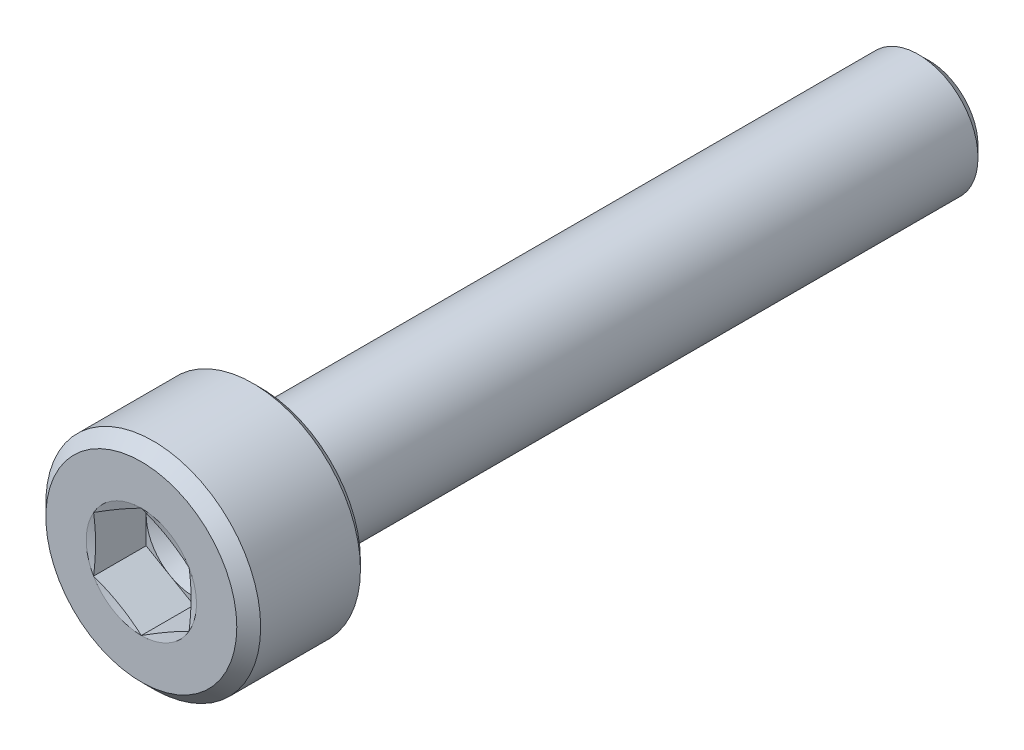
ISO-10303-21;
HEADER;
FILE_DESCRIPTION(('STEP AP214'),'2;1');
FILE_NAME('part.step','',(''),(''),'','','');
FILE_SCHEMA(('AUTOMOTIVE_DESIGN { 1 0 10303 214 1 1 1 1 }'));
ENDSEC;
DATA;
#1=APPLICATION_CONTEXT('core data for automotive mechanical design processes');
#2=APPLICATION_PROTOCOL_DEFINITION('international standard','automotive_design',2000,#1);
#3=PRODUCT_CONTEXT('',#1,'mechanical');
#4=PRODUCT('Part','Part','',(#3));
#5=PRODUCT_RELATED_PRODUCT_CATEGORY('part','',(#4));
#6=PRODUCT_DEFINITION_FORMATION('','',#4);
#7=PRODUCT_DEFINITION_CONTEXT('part definition',#1,'design');
#8=PRODUCT_DEFINITION('design','',#6,#7);
#9=PRODUCT_DEFINITION_SHAPE('','',#8);
#10=(LENGTH_UNIT() NAMED_UNIT(*) SI_UNIT(.MILLI.,.METRE.));
#11=(NAMED_UNIT(*) PLANE_ANGLE_UNIT() SI_UNIT($,.RADIAN.));
#12=(NAMED_UNIT(*) SI_UNIT($,.STERADIAN.) SOLID_ANGLE_UNIT());
#13=UNCERTAINTY_MEASURE_WITH_UNIT(LENGTH_MEASURE(1.E-05),#10,'distance_accuracy_value','');
#14=(GEOMETRIC_REPRESENTATION_CONTEXT(3) GLOBAL_UNCERTAINTY_ASSIGNED_CONTEXT((#13)) GLOBAL_UNIT_ASSIGNED_CONTEXT((#10,
#11,#12)) REPRESENTATION_CONTEXT('',''));
#15=CARTESIAN_POINT('',(0.,0.,0.));
#16=DIRECTION('',(0.,0.,1.));
#17=DIRECTION('',(1.,0.,0.));
#18=AXIS2_PLACEMENT_3D('',#15,#16,#17);
#19=CARTESIAN_POINT('',(0.,0.,0.));
#20=DIRECTION('',(0.,0.,-1.));
#21=DIRECTION('',(-1.,0.,0.));
#22=AXIS2_PLACEMENT_3D('',#19,#20,#21);
#23=PLANE('',#22);
#24=CARTESIAN_POINT('',(0.,0.,0.));
#25=DIRECTION('',(0.,0.,1.));
#26=DIRECTION('',(1.,0.,0.));
#27=AXIS2_PLACEMENT_3D('',#24,#25,#26);
#28=CIRCLE('',#27,1.99999999999999);
#29=CARTESIAN_POINT('',(1.99999999999999,0.,0.));
#30=VERTEX_POINT('',#29);
#31=EDGE_CURVE('E230',#30,#30,#28,.T.);
#32=ORIENTED_EDGE('',*,*,#31,.T.);
#33=EDGE_LOOP('',(#32));
#34=FACE_BOUND('',#33,.T.);
#35=CARTESIAN_POINT('',(0.,0.,0.));
#36=DIRECTION('',(0.,0.,1.));
#37=DIRECTION('',(1.,0.,0.));
#38=AXIS2_PLACEMENT_3D('',#35,#36,#37);
#39=CIRCLE('',#38,1.15470053837925);
#40=CARTESIAN_POINT('',(-1.,-0.577350269189627,0.));
#41=VERTEX_POINT('',#40);
#42=CARTESIAN_POINT('',(0.,-1.15470053837925,0.));
#43=VERTEX_POINT('',#42);
#44=EDGE_CURVE('E156',#41,#43,#39,.T.);
#45=ORIENTED_EDGE('',*,*,#44,.F.);
#46=CARTESIAN_POINT('',(-1.,0.577350269189626,0.));
#47=VERTEX_POINT('',#46);
#48=EDGE_CURVE('E155',#47,#41,#39,.T.);
#49=ORIENTED_EDGE('',*,*,#48,.F.);
#50=CARTESIAN_POINT('',(0.,1.15470053837925,0.));
#51=VERTEX_POINT('',#50);
#52=EDGE_CURVE('E122',#51,#47,#39,.T.);
#53=ORIENTED_EDGE('',*,*,#52,.F.);
#54=CARTESIAN_POINT('',(1.,0.577350269189627,0.));
#55=VERTEX_POINT('',#54);
#56=EDGE_CURVE('E116',#55,#51,#39,.T.);
#57=ORIENTED_EDGE('',*,*,#56,.F.);
#58=CARTESIAN_POINT('',(1.,-0.577350269189625,0.));
#59=VERTEX_POINT('',#58);
#60=EDGE_CURVE('E124',#59,#55,#39,.T.);
#61=ORIENTED_EDGE('',*,*,#60,.F.);
#62=EDGE_CURVE('E314',#43,#59,#39,.T.);
#63=ORIENTED_EDGE('',*,*,#62,.F.);
#64=EDGE_LOOP('',(#45,#49,#53,#57,#61,#63));
#65=FACE_BOUND('',#64,.T.);
#66=ADVANCED_FACE('F39',(#34,#65),#23,.F.);
#67=CARTESIAN_POINT('',(0.,0.,-0.25));
#68=DIRECTION('',(0.,0.,-1.));
#69=DIRECTION('',(-1.,0.,0.));
#70=AXIS2_PLACEMENT_3D('',#67,#68,#69);
#71=CONICAL_SURFACE('',#70,2.25,0.78539816339746);
#72=ORIENTED_EDGE('',*,*,#31,.F.);
#73=EDGE_LOOP('',(#72));
#74=FACE_BOUND('',#73,.T.);
#75=CARTESIAN_POINT('',(0.,0.,-0.25));
#76=DIRECTION('',(0.,0.,1.));
#77=DIRECTION('',(1.,0.,0.));
#78=AXIS2_PLACEMENT_3D('',#75,#76,#77);
#79=CIRCLE('',#78,2.25);
#80=CARTESIAN_POINT('',(2.25,0.,-0.25));
#81=VERTEX_POINT('',#80);
#82=EDGE_CURVE('E232',#81,#81,#79,.T.);
#83=ORIENTED_EDGE('',*,*,#82,.T.);
#84=EDGE_LOOP('',(#83));
#85=FACE_BOUND('',#84,.T.);
#86=ADVANCED_FACE('F221',(#74,#85),#71,.T.);
#87=CARTESIAN_POINT('',(0.,0.,0.));
#88=DIRECTION('',(0.,0.,1.));
#89=DIRECTION('',(1.,0.,0.));
#90=AXIS2_PLACEMENT_3D('',#87,#88,#89);
#91=CYLINDRICAL_SURFACE('',#90,2.25);
#92=ORIENTED_EDGE('',*,*,#82,.F.);
#93=EDGE_LOOP('',(#92));
#94=FACE_BOUND('',#93,.T.);
#95=CARTESIAN_POINT('',(0.,0.,-2.34));
#96=DIRECTION('',(0.,0.,1.));
#97=DIRECTION('',(1.,0.,0.));
#98=AXIS2_PLACEMENT_3D('',#95,#96,#97);
#99=CIRCLE('',#98,2.25);
#100=CARTESIAN_POINT('',(2.25,0.,-2.34));
#101=VERTEX_POINT('',#100);
#102=EDGE_CURVE('E235',#101,#101,#99,.T.);
#103=ORIENTED_EDGE('',*,*,#102,.T.);
#104=EDGE_LOOP('',(#103));
#105=FACE_BOUND('',#104,.T.);
#106=ADVANCED_FACE('F226',(#94,#105),#91,.T.);
#107=CARTESIAN_POINT('',(0.,0.,-2.5));
#108=DIRECTION('',(0.,0.,1.));
#109=DIRECTION('',(1.,0.,0.));
#110=AXIS2_PLACEMENT_3D('',#107,#108,#109);
#111=CONICAL_SURFACE('',#110,2.09,0.78539816339745);
#112=ORIENTED_EDGE('',*,*,#102,.F.);
#113=EDGE_LOOP('',(#112));
#114=FACE_BOUND('',#113,.T.);
#115=CARTESIAN_POINT('',(0.,0.,-2.5));
#116=DIRECTION('',(0.,0.,1.));
#117=DIRECTION('',(1.,0.,0.));
#118=AXIS2_PLACEMENT_3D('',#115,#116,#117);
#119=CIRCLE('',#118,2.09);
#120=CARTESIAN_POINT('',(2.09,0.,-2.5));
#121=VERTEX_POINT('',#120);
#122=EDGE_CURVE('E240',#121,#121,#119,.T.);
#123=ORIENTED_EDGE('',*,*,#122,.T.);
#124=EDGE_LOOP('',(#123));
#125=FACE_BOUND('',#124,.T.);
#126=ADVANCED_FACE('F430',(#114,#125),#111,.T.);
#127=CARTESIAN_POINT('',(0.,2.09,-2.5));
#128=DIRECTION('',(0.,0.,1.));
#129=DIRECTION('',(1.,0.,0.));
#130=AXIS2_PLACEMENT_3D('',#127,#128,#129);
#131=PLANE('',#130);
#132=ORIENTED_EDGE('',*,*,#122,.F.);
#133=EDGE_LOOP('',(#132));
#134=FACE_BOUND('',#133,.T.);
#135=CARTESIAN_POINT('',(0.,0.,-2.5));
#136=DIRECTION('',(0.,0.,1.));
#137=DIRECTION('',(1.,0.,0.));
#138=AXIS2_PLACEMENT_3D('',#135,#136,#137);
#139=CIRCLE('',#138,1.55);
#140=CARTESIAN_POINT('',(1.55,0.,-2.5));
#141=VERTEX_POINT('',#140);
#142=EDGE_CURVE('E243',#141,#141,#139,.T.);
#143=ORIENTED_EDGE('',*,*,#142,.T.);
#144=EDGE_LOOP('',(#143));
#145=FACE_BOUND('',#144,.T.);
#146=ADVANCED_FACE('F422',(#134,#145),#131,.F.);
#147=CARTESIAN_POINT('',(0.,0.,-2.6));
#148=DIRECTION('',(0.,0.,1.));
#149=DIRECTION('',(1.,0.,0.));
#150=AXIS2_PLACEMENT_3D('',#147,#148,#149);
#151=TOROIDAL_SURFACE('',#150,1.55,0.0999999999999999);
#152=ORIENTED_EDGE('',*,*,#142,.F.);
#153=EDGE_LOOP('',(#152));
#154=FACE_BOUND('',#153,.T.);
#155=CARTESIAN_POINT('',(0.,0.,-2.55615763679786));
#156=DIRECTION('',(0.,0.,1.));
#157=DIRECTION('',(1.,0.,0.));
#158=AXIS2_PLACEMENT_3D('',#155,#156,#157);
#159=CIRCLE('',#158,1.46012315543561);
#160=CARTESIAN_POINT('',(1.46012315543561,0.,-2.55615763679786));
#161=VERTEX_POINT('',#160);
#162=EDGE_CURVE('E246',#161,#161,#159,.T.);
#163=ORIENTED_EDGE('',*,*,#162,.T.);
#164=EDGE_LOOP('',(#163));
#165=FACE_BOUND('',#164,.T.);
#166=ADVANCED_FACE('F414',(#154,#165),#151,.F.);
#167=CARTESIAN_POINT('',(0.,0.,-2.96615763679786));
#168=DIRECTION('',(0.,0.,1.));
#169=DIRECTION('',(1.,0.,0.));
#170=AXIS2_PLACEMENT_3D('',#167,#168,#169);
#171=CONICAL_SURFACE('',#170,1.26012315543561,0.45384400152151);
#172=ORIENTED_EDGE('',*,*,#162,.F.);
#173=EDGE_LOOP('',(#172));
#174=FACE_BOUND('',#173,.T.);
#175=CARTESIAN_POINT('',(0.,0.,-2.96615763679786));
#176=DIRECTION('',(0.,0.,1.));
#177=DIRECTION('',(1.,0.,0.));
#178=AXIS2_PLACEMENT_3D('',#175,#176,#177);
#179=CIRCLE('',#178,1.26012315543561);
#180=CARTESIAN_POINT('',(1.26012315543561,0.,-2.96615763679786));
#181=VERTEX_POINT('',#180);
#182=EDGE_CURVE('E249',#181,#181,#179,.T.);
#183=ORIENTED_EDGE('',*,*,#182,.T.);
#184=EDGE_LOOP('',(#183));
#185=FACE_BOUND('',#184,.T.);
#186=ADVANCED_FACE('F406',(#174,#185),#171,.T.);
#187=CARTESIAN_POINT('',(0.,0.,-3.01));
#188=DIRECTION('',(0.,0.,1.));
#189=DIRECTION('',(1.,0.,0.));
#190=AXIS2_PLACEMENT_3D('',#187,#188,#189);
#191=TOROIDAL_SURFACE('',#190,1.35,0.1);
#192=ORIENTED_EDGE('',*,*,#182,.F.);
#193=EDGE_LOOP('',(#192));
#194=FACE_BOUND('',#193,.T.);
#195=CARTESIAN_POINT('',(0.,0.,-3.01));
#196=DIRECTION('',(0.,0.,1.));
#197=DIRECTION('',(1.,0.,0.));
#198=AXIS2_PLACEMENT_3D('',#195,#196,#197);
#199=CIRCLE('',#198,1.25);
#200=CARTESIAN_POINT('',(1.25,0.,-3.01));
#201=VERTEX_POINT('',#200);
#202=EDGE_CURVE('E252',#201,#201,#199,.T.);
#203=ORIENTED_EDGE('',*,*,#202,.T.);
#204=EDGE_LOOP('',(#203));
#205=FACE_BOUND('',#204,.T.);
#206=ADVANCED_FACE('F398',(#194,#205),#191,.F.);
#207=CARTESIAN_POINT('',(0.,0.,0.));
#208=DIRECTION('',(0.,0.,1.));
#209=DIRECTION('',(1.,0.,0.));
#210=AXIS2_PLACEMENT_3D('',#207,#208,#209);
#211=CYLINDRICAL_SURFACE('',#210,1.25);
#212=ORIENTED_EDGE('',*,*,#202,.F.);
#213=EDGE_LOOP('',(#212));
#214=FACE_BOUND('',#213,.T.);
#215=CARTESIAN_POINT('',(0.,0.,-16.275));
#216=DIRECTION('',(0.,0.,1.));
#217=DIRECTION('',(1.,0.,0.));
#218=AXIS2_PLACEMENT_3D('',#215,#216,#217);
#219=CIRCLE('',#218,1.25);
#220=CARTESIAN_POINT('',(1.25,0.,-16.275));
#221=VERTEX_POINT('',#220);
#222=EDGE_CURVE('E255',#221,#221,#219,.T.);
#223=ORIENTED_EDGE('',*,*,#222,.T.);
#224=EDGE_LOOP('',(#223));
#225=FACE_BOUND('',#224,.T.);
#226=ADVANCED_FACE('F389',(#214,#225),#211,.T.);
#227=CARTESIAN_POINT('',(0.,0.,-16.5));
#228=DIRECTION('',(0.,0.,1.));
#229=DIRECTION('',(1.,0.,0.));
#230=AXIS2_PLACEMENT_3D('',#227,#228,#229);
#231=CONICAL_SURFACE('',#230,1.025,0.785398163397434);
#232=ORIENTED_EDGE('',*,*,#222,.F.);
#233=EDGE_LOOP('',(#232));
#234=FACE_BOUND('',#233,.T.);
#235=CARTESIAN_POINT('',(0.,0.,-16.5));
#236=DIRECTION('',(0.,0.,1.));
#237=DIRECTION('',(1.,0.,0.));
#238=AXIS2_PLACEMENT_3D('',#235,#236,#237);
#239=CIRCLE('',#238,1.025);
#240=CARTESIAN_POINT('',(1.025,0.,-16.5));
#241=VERTEX_POINT('',#240);
#242=EDGE_CURVE('E258',#241,#241,#239,.T.);
#243=ORIENTED_EDGE('',*,*,#242,.T.);
#244=EDGE_LOOP('',(#243));
#245=FACE_BOUND('',#244,.T.);
#246=ADVANCED_FACE('F381',(#234,#245),#231,.T.);
#247=CARTESIAN_POINT('',(0.,1.025,-16.5));
#248=DIRECTION('',(0.,0.,1.));
#249=DIRECTION('',(1.,0.,0.));
#250=AXIS2_PLACEMENT_3D('',#247,#248,#249);
#251=PLANE('',#250);
#252=ORIENTED_EDGE('',*,*,#242,.F.);
#253=EDGE_LOOP('',(#252));
#254=FACE_BOUND('',#253,.T.);
#255=ADVANCED_FACE('F375',(#254),#251,.F.);
#256=CARTESIAN_POINT('',(0.,0.,-0.0414518843273794));
#257=DIRECTION('',(0.,0.,1.));
#258=DIRECTION('',(1.,0.,0.));
#259=AXIS2_PLACEMENT_3D('',#256,#257,#258);
#260=CONICAL_SURFACE('',#259,1.,1.30899693899575);
#261=ORIENTED_EDGE('',*,*,#52,.T.);
#262=CARTESIAN_POINT('',(-1.0002,0.577234799135788,3.09447482278448E-05));
#263=CARTESIAN_POINT('',(-0.958655967052366,0.601220257741327,-0.0064002937286438));
#264=CARTESIAN_POINT('',(-0.917036582427496,0.625249220658002,-0.0122389167538879));
#265=CARTESIAN_POINT('',(-0.833650751017785,0.673392052869,-0.0224969747320129));
#266=CARTESIAN_POINT('',(-0.791884251387769,0.697505952673498,-0.0269158325533612));
#267=CARTESIAN_POINT('',(-0.708457564222419,0.745672372966012,-0.0340762610726339));
#268=CARTESIAN_POINT('',(-0.666797941488531,0.76972456736576,-0.0368263755153267));
#269=CARTESIAN_POINT('',(-0.583425537926818,0.817859647005101,-0.0405140115840561));
#270=CARTESIAN_POINT('',(-0.541712768963409,0.84194252539477,-0.0414518843273794));
#271=CARTESIAN_POINT('',(-0.458287231036591,0.890108282174108,-0.0414518843273794));
#272=CARTESIAN_POINT('',(-0.416574462073183,0.914191160563776,-0.0405140115840562));
#273=CARTESIAN_POINT('',(-0.333202058511469,0.962326240203118,-0.0368263755153268));
#274=CARTESIAN_POINT('',(-0.291542435777581,0.986378434602866,-0.0340762610726339));
#275=CARTESIAN_POINT('',(-0.208115748612231,1.03454485489538,-0.0269158325533612));
#276=CARTESIAN_POINT('',(-0.166349248982215,1.05865875469988,-0.022496974732013));
#277=CARTESIAN_POINT('',(-0.082963417572504,1.10680158691088,-0.0122389167538879));
#278=CARTESIAN_POINT('',(-0.0413440329476342,1.13083054982755,-0.00640029372864383));
#279=CARTESIAN_POINT('',(0.000199999999999712,1.15481600843309,3.09447482277791E-05));
#280=B_SPLINE_CURVE_WITH_KNOTS('',3,(#262,#263,#264,#265,#266,#267,#268,#269,#270,#271,#272,
#273,#274,#275,#276,#277,#278,#279),.UNSPECIFIED.,.F.,.F.,(4,2,2,2,2,2,2,2,4),(0.,
0.145207919576138,0.290474791401637,0.434991498754472,0.579480203548904,0.723968908343337,
0.868485615696171,1.01375248752167,1.15896040709781),.UNSPECIFIED.);
#281=EDGE_CURVE('E11',#47,#51,#280,.T.);
#282=ORIENTED_EDGE('',*,*,#281,.T.);
#283=EDGE_LOOP('',(#261,#282));
#284=FACE_BOUND('',#283,.T.);
#285=ADVANCED_FACE('F128',(#284),#260,.F.);
#286=CARTESIAN_POINT('',(-1.,-1.52643011498151,0.179559500328905));
#287=CARTESIAN_POINT('',(-1.,-1.48107281675449,0.169395016518442));
#288=CARTESIAN_POINT('',(-1.,-1.43568725345209,0.159356656043633));
#289=CARTESIAN_POINT('',(-1.,-1.34484539671837,0.139595995945807));
#290=CARTESIAN_POINT('',(-1.,-1.29938910031521,0.129873710000082));
#291=CARTESIAN_POINT('',(-1.,-1.16281081948406,0.101259588992851));
#292=CARTESIAN_POINT('',(-1.,-1.07156700396997,0.082940372456614));
#293=CARTESIAN_POINT('',(-1.,-0.88936601076796,0.0487667600882851));
#294=CARTESIAN_POINT('',(-1.,-0.79841237483623,0.0328938269072127));
#295=CARTESIAN_POINT('',(-1.,-0.615958025050498,0.00466708117239791));
#296=CARTESIAN_POINT('',(-1.,-0.524457409264859,-0.00768734397506349));
#297=CARTESIAN_POINT('',(-1.,-0.339832532923292,-0.0273176846992072));
#298=CARTESIAN_POINT('',(-1.,-0.246701609077917,-0.0345346333765504));
#299=CARTESIAN_POINT('',(-1.,-0.0601848537429605,-0.0420970268618835));
#300=CARTESIAN_POINT('',(-1.,0.0332008255159849,-0.0424459350511283));
#301=CARTESIAN_POINT('',(-1.,0.220062126607415,-0.0361782478413628));
#302=CARTESIAN_POINT('',(-1.,0.313536815760406,-0.0295360263089438));
#303=CARTESIAN_POINT('',(-1.,0.499961845088041,-0.0107328584522726));
#304=CARTESIAN_POINT('',(-1.,0.592911753290236,0.00143210787400266));
#305=CARTESIAN_POINT('',(-1.,0.772008575805923,0.0285670343131764));
#306=CARTESIAN_POINT('',(-1.,0.858193708387106,0.0432941924343233));
#307=CARTESIAN_POINT('',(-1.,1.03016717772571,0.0749298889380194));
#308=CARTESIAN_POINT('',(-1.,1.11595546297609,0.0918387026820596));
#309=CARTESIAN_POINT('',(-1.,1.28724540813596,0.127118242180317));
#310=CARTESIAN_POINT('',(-1.,1.3727470067179,0.145489262227993));
#311=CARTESIAN_POINT('',(-1.,1.54353013969748,0.183229077127881));
#312=CARTESIAN_POINT('',(-1.,1.62881166956928,0.20259789233124));
#313=CARTESIAN_POINT('',(-1.,1.7983713397346,0.241841227584754));
#314=CARTESIAN_POINT('',(-1.,1.88265107803333,0.261708872629386));
#315=CARTESIAN_POINT('',(-1.,2.05109298923673,0.301941880268232));
#316=CARTESIAN_POINT('',(-1.,2.13525515997927,0.322307251891818));
#317=CARTESIAN_POINT('',(-1.,2.30338603162311,0.363380416802524));
#318=CARTESIAN_POINT('',(-1.,2.38735484316584,0.384087758171203));
#319=CARTESIAN_POINT('',(-1.,2.55521929237511,0.425785409216644));
#320=CARTESIAN_POINT('',(-1.,2.63911493235977,0.44677570955473));
#321=CARTESIAN_POINT('',(-1.,2.72298506302481,0.467866264564868));
#322=B_SPLINE_CURVE_WITH_KNOTS('',3,(#286,#287,#288,#289,#290,#291,#292,#293,#294,#295,#296,
#297,#298,#299,#300,#301,#302,#303,#304,#305,#306,#307,#308,#309,#310,#311,#312,#313,#314,#315,
#316,#317,#318,#319,#320,#321),.UNSPECIFIED.,.F.,.F.,(4,2,2,2,2,2,2,2,2,2,2,2,2,2,2,2,2,4),(0.,
0.139446387362517,0.278898800889487,0.558072969705209,0.83501487467604,1.11190853285321,
1.39193120330635,1.67181266170224,1.95272361613476,2.23383937411111,2.49610397036315,
2.75840170124238,3.02075235807066,3.28310836795421,3.54287585506842,3.80264805818657,
4.06210078846756,4.3215449767274),.UNSPECIFIED.);
#323=EDGE_CURVE('E121',#41,#47,#322,.T.);
#324=ORIENTED_EDGE('',*,*,#323,.T.);
#325=ORIENTED_EDGE('',*,*,#48,.T.);
#326=EDGE_LOOP('',(#324,#325));
#327=FACE_BOUND('',#326,.T.);
#328=ADVANCED_FACE('F362',(#327),#260,.F.);
#329=CARTESIAN_POINT('',(0.00020000000000009,-1.15481600843309,3.0944748227671E-05));
#330=CARTESIAN_POINT('',(-0.0413440329476337,-1.13083054982755,-0.00640029372864397));
#331=CARTESIAN_POINT('',(-0.0829634175725036,-1.10680158691087,-0.012238916753888));
#332=CARTESIAN_POINT('',(-0.166349248982215,-1.05865875469988,-0.0224969747320131));
#333=CARTESIAN_POINT('',(-0.208115748612231,-1.03454485489538,-0.0269158325533613));
#334=CARTESIAN_POINT('',(-0.291542435777581,-0.986378434602866,-0.034076261072634));
#335=CARTESIAN_POINT('',(-0.333202058511469,-0.962326240203117,-0.0368263755153269));
#336=CARTESIAN_POINT('',(-0.416574462073182,-0.914191160563776,-0.0405140115840563));
#337=CARTESIAN_POINT('',(-0.458287231036591,-0.890108282174107,-0.0414518843273795));
#338=CARTESIAN_POINT('',(-0.541712768963409,-0.84194252539477,-0.0414518843273795));
#339=CARTESIAN_POINT('',(-0.583425537926817,-0.817859647005101,-0.0405140115840563));
#340=CARTESIAN_POINT('',(-0.666797941488531,-0.769724567365759,-0.0368263755153269));
#341=CARTESIAN_POINT('',(-0.708457564222419,-0.745672372966011,-0.034076261072634));
#342=CARTESIAN_POINT('',(-0.791884251387769,-0.697505952673497,-0.0269158325533614));
#343=CARTESIAN_POINT('',(-0.833650751017785,-0.673392052868999,-0.0224969747320131));
#344=CARTESIAN_POINT('',(-0.917036582427496,-0.625249220658002,-0.012238916753888));
#345=CARTESIAN_POINT('',(-0.958655967052366,-0.601220257741327,-0.00640029372864395));
#346=CARTESIAN_POINT('',(-1.0002,-0.577234799135788,3.09447482276755E-05));
#347=B_SPLINE_CURVE_WITH_KNOTS('',3,(#329,#330,#331,#332,#333,#334,#335,#336,#337,#338,#339,
#340,#341,#342,#343,#344,#345,#346),.UNSPECIFIED.,.F.,.F.,(4,2,2,2,2,2,2,2,4),(0.,
0.145207919576138,0.290474791401637,0.434991498754472,0.579480203548905,0.723968908343337,
0.868485615696172,1.01375248752167,1.15896040709781),.UNSPECIFIED.);
#348=EDGE_CURVE('E164',#43,#41,#347,.T.);
#349=ORIENTED_EDGE('',*,*,#348,.T.);
#350=ORIENTED_EDGE('',*,*,#44,.T.);
#351=EDGE_LOOP('',(#349,#350));
#352=FACE_BOUND('',#351,.T.);
#353=ADVANCED_FACE('F356',(#352),#260,.F.);
#354=CARTESIAN_POINT('',(1.0002,-0.577234799135788,3.09447482277853E-05));
#355=CARTESIAN_POINT('',(0.958655967052366,-0.601220257741327,-0.00640029372864384));
#356=CARTESIAN_POINT('',(0.917036582427496,-0.625249220658002,-0.0122389167538879));
#357=CARTESIAN_POINT('',(0.833650751017785,-0.673392052869,-0.022496974732013));
#358=CARTESIAN_POINT('',(0.791884251387769,-0.697505952673498,-0.0269158325533613));
#359=CARTESIAN_POINT('',(0.708457564222419,-0.745672372966011,-0.034076261072634));
#360=CARTESIAN_POINT('',(0.666797941488531,-0.76972456736576,-0.0368263755153268));
#361=CARTESIAN_POINT('',(0.583425537926817,-0.817859647005101,-0.0405140115840562));
#362=CARTESIAN_POINT('',(0.541712768963409,-0.84194252539477,-0.0414518843273794));
#363=CARTESIAN_POINT('',(0.458287231036591,-0.890108282174107,-0.0414518843273794));
#364=CARTESIAN_POINT('',(0.416574462073182,-0.914191160563776,-0.0405140115840562));
#365=CARTESIAN_POINT('',(0.333202058511469,-0.962326240203118,-0.0368263755153268));
#366=CARTESIAN_POINT('',(0.291542435777581,-0.986378434602866,-0.034076261072634));
#367=CARTESIAN_POINT('',(0.208115748612231,-1.03454485489538,-0.0269158325533613));
#368=CARTESIAN_POINT('',(0.166349248982215,-1.05865875469988,-0.0224969747320131));
#369=CARTESIAN_POINT('',(0.0829634175725038,-1.10680158691088,-0.0122389167538881));
#370=CARTESIAN_POINT('',(0.0413440329476339,-1.13083054982755,-0.00640029372864397));
#371=CARTESIAN_POINT('',(-0.000199999999999965,-1.15481600843309,3.09447482276549E-05));
#372=B_SPLINE_CURVE_WITH_KNOTS('',3,(#354,#355,#356,#357,#358,#359,#360,#361,#362,#363,#364,
#365,#366,#367,#368,#369,#370,#371),.UNSPECIFIED.,.F.,.F.,(4,2,2,2,2,2,2,2,4),(0.,
0.145207919576138,0.290474791401637,0.434991498754472,0.579480203548904,0.723968908343337,
0.868485615696171,1.01375248752167,1.15896040709781),.UNSPECIFIED.);
#373=EDGE_CURVE('E184',#59,#43,#372,.T.);
#374=ORIENTED_EDGE('',*,*,#373,.T.);
#375=ORIENTED_EDGE('',*,*,#62,.T.);
#376=EDGE_LOOP('',(#374,#375));
#377=FACE_BOUND('',#376,.T.);
#378=ADVANCED_FACE('F350',(#377),#260,.F.);
#379=CARTESIAN_POINT('',(1.,-1.52643011498151,0.179559500328905));
#380=CARTESIAN_POINT('',(1.,-1.48107281675449,0.169395016518442));
#381=CARTESIAN_POINT('',(1.,-1.43568725345209,0.159356656043633));
#382=CARTESIAN_POINT('',(1.,-1.34484539671837,0.139595995945807));
#383=CARTESIAN_POINT('',(1.,-1.29938910031521,0.129873710000082));
#384=CARTESIAN_POINT('',(1.,-1.16281081948406,0.101259588992851));
#385=CARTESIAN_POINT('',(1.,-1.07156700396997,0.0829403724566141));
#386=CARTESIAN_POINT('',(1.,-0.889366010767961,0.0487667600882852));
#387=CARTESIAN_POINT('',(1.,-0.798412374836231,0.0328938269072127));
#388=CARTESIAN_POINT('',(1.,-0.615958025050498,0.00466708117239788));
#389=CARTESIAN_POINT('',(1.,-0.524457409264859,-0.00768734397506349));
#390=CARTESIAN_POINT('',(1.,-0.339832532923292,-0.0273176846992072));
#391=CARTESIAN_POINT('',(1.,-0.246701609077917,-0.0345346333765504));
#392=CARTESIAN_POINT('',(1.,-0.0601848537429606,-0.0420970268618835));
#393=CARTESIAN_POINT('',(1.,0.0332008255159848,-0.0424459350511284));
#394=CARTESIAN_POINT('',(1.,0.220062126607415,-0.0361782478413629));
#395=CARTESIAN_POINT('',(1.,0.313536815760406,-0.0295360263089439));
#396=CARTESIAN_POINT('',(1.,0.49996184508804,-0.0107328584522727));
#397=CARTESIAN_POINT('',(1.,0.592911753290235,0.00143210787400255));
#398=CARTESIAN_POINT('',(1.,0.772008575805923,0.0285670343131763));
#399=CARTESIAN_POINT('',(1.,0.858193708387105,0.0432941924343232));
#400=CARTESIAN_POINT('',(1.,1.03016717772571,0.0749298889380192));
#401=CARTESIAN_POINT('',(1.,1.11595546297609,0.0918387026820593));
#402=CARTESIAN_POINT('',(1.,1.28724540813596,0.127118242180317));
#403=CARTESIAN_POINT('',(1.,1.3727470067179,0.145489262227993));
#404=CARTESIAN_POINT('',(1.,1.54353013969748,0.18322907712788));
#405=CARTESIAN_POINT('',(1.,1.62881166956928,0.20259789233124));
#406=CARTESIAN_POINT('',(1.,1.79837133973459,0.241841227584754));
#407=CARTESIAN_POINT('',(1.,1.88265107803333,0.261708872629385));
#408=CARTESIAN_POINT('',(1.,2.05109298923673,0.301941880268232));
#409=CARTESIAN_POINT('',(1.,2.13525515997927,0.322307251891818));
#410=CARTESIAN_POINT('',(1.,2.30338603162311,0.363380416802524));
#411=CARTESIAN_POINT('',(1.,2.38735484316584,0.384087758171203));
#412=CARTESIAN_POINT('',(1.,2.55521929237511,0.425785409216644));
#413=CARTESIAN_POINT('',(1.,2.63911493235977,0.44677570955473));
#414=CARTESIAN_POINT('',(1.,2.72298506302481,0.467866264564868));
#415=B_SPLINE_CURVE_WITH_KNOTS('',3,(#379,#380,#381,#382,#383,#384,#385,#386,#387,#388,#389,
#390,#391,#392,#393,#394,#395,#396,#397,#398,#399,#400,#401,#402,#403,#404,#405,#406,#407,#408,
#409,#410,#411,#412,#413,#414),.UNSPECIFIED.,.F.,.F.,(4,2,2,2,2,2,2,2,2,2,2,2,2,2,2,2,2,4),(0.,
0.139446387362517,0.278898800889487,0.558072969705209,0.83501487467604,1.11190853285321,
1.39193120330636,1.67181266170225,1.95272361613476,2.23383937411111,2.49610397036315,
2.75840170124238,3.02075235807066,3.28310836795421,3.54287585506841,3.80264805818657,
4.06210078846756,4.3215449767274),.UNSPECIFIED.);
#416=EDGE_CURVE('E64',#55,#59,#415,.F.);
#417=ORIENTED_EDGE('',*,*,#416,.T.);
#418=ORIENTED_EDGE('',*,*,#60,.T.);
#419=EDGE_LOOP('',(#417,#418));
#420=FACE_BOUND('',#419,.T.);
#421=ADVANCED_FACE('F177',(#420),#260,.F.);
#422=CARTESIAN_POINT('',(-0.000199999999999992,1.15481600843309,3.09447482277502E-05));
#423=CARTESIAN_POINT('',(0.0413440329476338,1.13083054982755,-0.00640029372864384));
#424=CARTESIAN_POINT('',(0.0829634175725037,1.10680158691088,-0.0122389167538879));
#425=CARTESIAN_POINT('',(0.166349248982215,1.05865875469988,-0.0224969747320129));
#426=CARTESIAN_POINT('',(0.208115748612231,1.03454485489538,-0.0269158325533612));
#427=CARTESIAN_POINT('',(0.291542435777581,0.986378434602866,-0.0340762610726339));
#428=CARTESIAN_POINT('',(0.333202058511469,0.962326240203118,-0.0368263755153268));
#429=CARTESIAN_POINT('',(0.416574462073182,0.914191160563776,-0.0405140115840562));
#430=CARTESIAN_POINT('',(0.458287231036591,0.890108282174108,-0.0414518843273794));
#431=CARTESIAN_POINT('',(0.541712768963409,0.84194252539477,-0.0414518843273794));
#432=CARTESIAN_POINT('',(0.583425537926817,0.817859647005102,-0.0405140115840561));
#433=CARTESIAN_POINT('',(0.666797941488531,0.76972456736576,-0.0368263755153267));
#434=CARTESIAN_POINT('',(0.708457564222419,0.745672372966012,-0.0340762610726339));
#435=CARTESIAN_POINT('',(0.791884251387769,0.697505952673498,-0.0269158325533613));
#436=CARTESIAN_POINT('',(0.833650751017785,0.673392052869,-0.022496974732013));
#437=CARTESIAN_POINT('',(0.917036582427496,0.625249220658003,-0.012238916753888));
#438=CARTESIAN_POINT('',(0.958655967052366,0.601220257741328,-0.00640029372864386));
#439=CARTESIAN_POINT('',(1.0002,0.577234799135788,3.09447482277283E-05));
#440=B_SPLINE_CURVE_WITH_KNOTS('',3,(#422,#423,#424,#425,#426,#427,#428,#429,#430,#431,#432,
#433,#434,#435,#436,#437,#438,#439),.UNSPECIFIED.,.F.,.F.,(4,2,2,2,2,2,2,2,4),(0.,
0.145207919576138,0.290474791401637,0.434991498754472,0.579480203548904,0.723968908343336,
0.868485615696171,1.01375248752167,1.15896040709781),.UNSPECIFIED.);
#441=EDGE_CURVE('E58',#51,#55,#440,.T.);
#442=ORIENTED_EDGE('',*,*,#441,.T.);
#443=ORIENTED_EDGE('',*,*,#56,.T.);
#444=EDGE_LOOP('',(#442,#443));
#445=FACE_BOUND('',#444,.T.);
#446=ADVANCED_FACE('F117',(#445),#260,.F.);
#447=CARTESIAN_POINT('',(0.,0.,-1.67735026918962));
#448=DIRECTION('',(0.,0.,1.));
#449=DIRECTION('',(1.,0.,0.));
#450=AXIS2_PLACEMENT_3D('',#447,#448,#449);
#451=CONICAL_SURFACE('',#450,0.,1.0471975511966);
#452=CARTESIAN_POINT('',(0.,0.,-1.1));
#453=DIRECTION('',(0.,0.,1.));
#454=DIRECTION('',(1.,0.,0.));
#455=AXIS2_PLACEMENT_3D('',#452,#453,#454);
#456=CIRCLE('',#455,1.);
#457=CARTESIAN_POINT('',(1.,0.,-1.1));
#458=VERTEX_POINT('',#457);
#459=CARTESIAN_POINT('',(0.5,0.866025403784439,-1.1));
#460=VERTEX_POINT('',#459);
#461=EDGE_CURVE('E144',#458,#460,#456,.T.);
#462=ORIENTED_EDGE('',*,*,#461,.T.);
#463=CARTESIAN_POINT('',(-0.5,0.866025403784439,-1.1));
#464=VERTEX_POINT('',#463);
#465=EDGE_CURVE('E52',#460,#464,#456,.T.);
#466=ORIENTED_EDGE('',*,*,#465,.T.);
#467=CARTESIAN_POINT('',(-1.,0.,-1.1));
#468=VERTEX_POINT('',#467);
#469=EDGE_CURVE('E295',#464,#468,#456,.T.);
#470=ORIENTED_EDGE('',*,*,#469,.T.);
#471=CARTESIAN_POINT('',(-0.5,-0.866025403784439,-1.1));
#472=VERTEX_POINT('',#471);
#473=EDGE_CURVE('E297',#468,#472,#456,.T.);
#474=ORIENTED_EDGE('',*,*,#473,.T.);
#475=CARTESIAN_POINT('',(0.5,-0.866025403784439,-1.1));
#476=VERTEX_POINT('',#475);
#477=EDGE_CURVE('E233',#472,#476,#456,.T.);
#478=ORIENTED_EDGE('',*,*,#477,.T.);
#479=EDGE_CURVE('E231',#476,#458,#456,.T.);
#480=ORIENTED_EDGE('',*,*,#479,.T.);
#481=EDGE_LOOP('',(#462,#466,#470,#474,#478,#480));
#482=FACE_BOUND('',#481,.T.);
#483=CARTESIAN_POINT('',(0.,0.,-1.67735026918962));
#484=VERTEX_POINT('',#483);
#485=VERTEX_LOOP('',#484);
#486=FACE_BOUND('',#485,.T.);
#487=ADVANCED_FACE('F176',(#482,#486),#451,.F.);
#488=CARTESIAN_POINT('',(0.,0.,-1.1));
#489=DIRECTION('',(0.,0.,1.));
#490=DIRECTION('',(1.,0.,0.));
#491=AXIS2_PLACEMENT_3D('',#488,#489,#490);
#492=PLANE('',#491);
#493=ORIENTED_EDGE('',*,*,#461,.F.);
#494=DIRECTION('',(0.,1.,0.));
#495=VECTOR('',#494,1.);
#496=CARTESIAN_POINT('',(1.,-0.577350269189626,-1.1));
#497=LINE('',#496,#495);
#498=CARTESIAN_POINT('',(1.,0.577350269189626,-1.1));
#499=VERTEX_POINT('',#498);
#500=EDGE_CURVE('E274',#458,#499,#497,.T.);
#501=ORIENTED_EDGE('',*,*,#500,.T.);
#502=DIRECTION('',(-0.866025403784439,0.5,0.));
#503=VECTOR('',#502,1.);
#504=CARTESIAN_POINT('',(1.,0.577350269189626,-1.1));
#505=LINE('',#504,#503);
#506=EDGE_CURVE('E289',#499,#460,#505,.T.);
#507=ORIENTED_EDGE('',*,*,#506,.T.);
#508=EDGE_LOOP('',(#493,#501,#507));
#509=FACE_BOUND('',#508,.T.);
#510=ADVANCED_FACE('F319',(#509),#492,.T.);
#511=ORIENTED_EDGE('',*,*,#479,.F.);
#512=DIRECTION('',(0.866025403784439,0.5,0.));
#513=VECTOR('',#512,1.);
#514=CARTESIAN_POINT('',(0.,-1.15470053837925,-1.1));
#515=LINE('',#514,#513);
#516=CARTESIAN_POINT('',(1.,-0.577350269189626,-1.1));
#517=VERTEX_POINT('',#516);
#518=EDGE_CURVE('E278',#476,#517,#515,.T.);
#519=ORIENTED_EDGE('',*,*,#518,.T.);
#520=EDGE_CURVE('E151',#517,#458,#497,.T.);
#521=ORIENTED_EDGE('',*,*,#520,.T.);
#522=EDGE_LOOP('',(#511,#519,#521));
#523=FACE_BOUND('',#522,.T.);
#524=ADVANCED_FACE('F207',(#523),#492,.T.);
#525=ORIENTED_EDGE('',*,*,#477,.F.);
#526=DIRECTION('',(0.866025403784439,-0.5,0.));
#527=VECTOR('',#526,1.);
#528=CARTESIAN_POINT('',(-1.,-0.577350269189625,-1.1));
#529=LINE('',#528,#527);
#530=CARTESIAN_POINT('',(0.,-1.15470053837925,-1.1));
#531=VERTEX_POINT('',#530);
#532=EDGE_CURVE('E282',#472,#531,#529,.T.);
#533=ORIENTED_EDGE('',*,*,#532,.T.);
#534=EDGE_CURVE('E275',#531,#476,#515,.T.);
#535=ORIENTED_EDGE('',*,*,#534,.T.);
#536=EDGE_LOOP('',(#525,#533,#535));
#537=FACE_BOUND('',#536,.T.);
#538=ADVANCED_FACE('F310',(#537),#492,.T.);
#539=ORIENTED_EDGE('',*,*,#473,.F.);
#540=DIRECTION('',(0.,-1.,0.));
#541=VECTOR('',#540,1.);
#542=CARTESIAN_POINT('',(-1.,0.577350269189626,-1.1));
#543=LINE('',#542,#541);
#544=CARTESIAN_POINT('',(-1.,-0.577350269189625,-1.1));
#545=VERTEX_POINT('',#544);
#546=EDGE_CURVE('E286',#468,#545,#543,.T.);
#547=ORIENTED_EDGE('',*,*,#546,.T.);
#548=EDGE_CURVE('E279',#545,#472,#529,.T.);
#549=ORIENTED_EDGE('',*,*,#548,.T.);
#550=EDGE_LOOP('',(#539,#547,#549));
#551=FACE_BOUND('',#550,.T.);
#552=ADVANCED_FACE('F324',(#551),#492,.T.);
#553=ORIENTED_EDGE('',*,*,#465,.F.);
#554=CARTESIAN_POINT('',(0.,1.15470053837925,-1.1));
#555=VERTEX_POINT('',#554);
#556=EDGE_CURVE('E291',#460,#555,#505,.T.);
#557=ORIENTED_EDGE('',*,*,#556,.T.);
#558=DIRECTION('',(-0.866025403784439,-0.5,0.));
#559=VECTOR('',#558,1.);
#560=CARTESIAN_POINT('',(0.,1.15470053837925,-1.1));
#561=LINE('',#560,#559);
#562=EDGE_CURVE('E149',#555,#464,#561,.T.);
#563=ORIENTED_EDGE('',*,*,#562,.T.);
#564=EDGE_LOOP('',(#553,#557,#563));
#565=FACE_BOUND('',#564,.T.);
#566=ADVANCED_FACE('F321',(#565),#492,.T.);
#567=ORIENTED_EDGE('',*,*,#469,.F.);
#568=CARTESIAN_POINT('',(-1.,0.577350269189626,-1.1));
#569=VERTEX_POINT('',#568);
#570=EDGE_CURVE('E288',#464,#569,#561,.T.);
#571=ORIENTED_EDGE('',*,*,#570,.T.);
#572=EDGE_CURVE('E283',#569,#468,#543,.T.);
#573=ORIENTED_EDGE('',*,*,#572,.T.);
#574=EDGE_LOOP('',(#567,#571,#573));
#575=FACE_BOUND('',#574,.T.);
#576=ADVANCED_FACE('F323',(#575),#492,.T.);
#577=CARTESIAN_POINT('',(0.,1.15470053837925,-1.1));
#578=DIRECTION('',(-0.5,0.866025403784439,0.));
#579=DIRECTION('',(-0.866025403784439,-0.5,0.));
#580=AXIS2_PLACEMENT_3D('',#577,#578,#579);
#581=PLANE('',#580);
#582=ORIENTED_EDGE('',*,*,#281,.F.);
#583=DIRECTION('',(0.,0.,1.));
#584=VECTOR('',#583,1.);
#585=CARTESIAN_POINT('',(-1.,0.577350269189626,-1.1));
#586=LINE('',#585,#584);
#587=EDGE_CURVE('E150',#569,#47,#586,.T.);
#588=ORIENTED_EDGE('',*,*,#587,.F.);
#589=ORIENTED_EDGE('',*,*,#570,.F.);
#590=ORIENTED_EDGE('',*,*,#562,.F.);
#591=DIRECTION('',(0.,0.,1.));
#592=VECTOR('',#591,1.);
#593=CARTESIAN_POINT('',(0.,1.15470053837925,-1.1));
#594=LINE('',#593,#592);
#595=EDGE_CURVE('E139',#555,#51,#594,.T.);
#596=ORIENTED_EDGE('',*,*,#595,.T.);
#597=EDGE_LOOP('',(#582,#588,#589,#590,#596));
#598=FACE_BOUND('',#597,.T.);
#599=ADVANCED_FACE('F146',(#598),#581,.F.);
#600=CARTESIAN_POINT('',(-1.,0.577350269189626,-1.1));
#601=DIRECTION('',(-1.,0.,0.));
#602=DIRECTION('',(0.,0.,1.));
#603=AXIS2_PLACEMENT_3D('',#600,#601,#602);
#604=PLANE('',#603);
#605=ORIENTED_EDGE('',*,*,#323,.F.);
#606=DIRECTION('',(0.,0.,1.));
#607=VECTOR('',#606,1.);
#608=CARTESIAN_POINT('',(-1.,-0.577350269189625,-1.1));
#609=LINE('',#608,#607);
#610=EDGE_CURVE('E262',#545,#41,#609,.T.);
#611=ORIENTED_EDGE('',*,*,#610,.F.);
#612=ORIENTED_EDGE('',*,*,#546,.F.);
#613=ORIENTED_EDGE('',*,*,#572,.F.);
#614=ORIENTED_EDGE('',*,*,#587,.T.);
#615=EDGE_LOOP('',(#605,#611,#612,#613,#614));
#616=FACE_BOUND('',#615,.T.);
#617=ADVANCED_FACE('F171',(#616),#604,.F.);
#618=CARTESIAN_POINT('',(-1.,-0.577350269189625,-1.1));
#619=DIRECTION('',(-0.5,-0.866025403784439,0.));
#620=DIRECTION('',(0.866025403784439,-0.5,0.));
#621=AXIS2_PLACEMENT_3D('',#618,#619,#620);
#622=PLANE('',#621);
#623=ORIENTED_EDGE('',*,*,#348,.F.);
#624=DIRECTION('',(0.,0.,1.));
#625=VECTOR('',#624,1.);
#626=CARTESIAN_POINT('',(0.,-1.15470053837925,-1.1));
#627=LINE('',#626,#625);
#628=EDGE_CURVE('E265',#531,#43,#627,.T.);
#629=ORIENTED_EDGE('',*,*,#628,.F.);
#630=ORIENTED_EDGE('',*,*,#532,.F.);
#631=ORIENTED_EDGE('',*,*,#548,.F.);
#632=ORIENTED_EDGE('',*,*,#610,.T.);
#633=EDGE_LOOP('',(#623,#629,#630,#631,#632));
#634=FACE_BOUND('',#633,.T.);
#635=ADVANCED_FACE('F210',(#634),#622,.F.);
#636=CARTESIAN_POINT('',(0.,-1.15470053837925,-1.1));
#637=DIRECTION('',(0.5,-0.866025403784439,0.));
#638=DIRECTION('',(0.866025403784439,0.5,0.));
#639=AXIS2_PLACEMENT_3D('',#636,#637,#638);
#640=PLANE('',#639);
#641=ORIENTED_EDGE('',*,*,#373,.F.);
#642=DIRECTION('',(0.,0.,1.));
#643=VECTOR('',#642,1.);
#644=CARTESIAN_POINT('',(1.,-0.577350269189626,-1.1));
#645=LINE('',#644,#643);
#646=EDGE_CURVE('E268',#517,#59,#645,.T.);
#647=ORIENTED_EDGE('',*,*,#646,.F.);
#648=ORIENTED_EDGE('',*,*,#518,.F.);
#649=ORIENTED_EDGE('',*,*,#534,.F.);
#650=ORIENTED_EDGE('',*,*,#628,.T.);
#651=EDGE_LOOP('',(#641,#647,#648,#649,#650));
#652=FACE_BOUND('',#651,.T.);
#653=ADVANCED_FACE('F205',(#652),#640,.F.);
#654=CARTESIAN_POINT('',(1.,-0.577350269189626,-1.1));
#655=DIRECTION('',(1.,0.,0.));
#656=DIRECTION('',(0.,0.,-1.));
#657=AXIS2_PLACEMENT_3D('',#654,#655,#656);
#658=PLANE('',#657);
#659=ORIENTED_EDGE('',*,*,#416,.F.);
#660=DIRECTION('',(0.,0.,1.));
#661=VECTOR('',#660,1.);
#662=CARTESIAN_POINT('',(1.,0.577350269189626,-1.1));
#663=LINE('',#662,#661);
#664=EDGE_CURVE('E143',#499,#55,#663,.T.);
#665=ORIENTED_EDGE('',*,*,#664,.F.);
#666=ORIENTED_EDGE('',*,*,#500,.F.);
#667=ORIENTED_EDGE('',*,*,#520,.F.);
#668=ORIENTED_EDGE('',*,*,#646,.T.);
#669=EDGE_LOOP('',(#659,#665,#666,#667,#668));
#670=FACE_BOUND('',#669,.T.);
#671=ADVANCED_FACE('F202',(#670),#658,.F.);
#672=CARTESIAN_POINT('',(1.,0.577350269189626,-1.1));
#673=DIRECTION('',(0.5,0.866025403784439,0.));
#674=DIRECTION('',(-0.866025403784439,0.5,0.));
#675=AXIS2_PLACEMENT_3D('',#672,#673,#674);
#676=PLANE('',#675);
#677=ORIENTED_EDGE('',*,*,#441,.F.);
#678=ORIENTED_EDGE('',*,*,#595,.F.);
#679=ORIENTED_EDGE('',*,*,#556,.F.);
#680=ORIENTED_EDGE('',*,*,#506,.F.);
#681=ORIENTED_EDGE('',*,*,#664,.T.);
#682=EDGE_LOOP('',(#677,#678,#679,#680,#681));
#683=FACE_BOUND('',#682,.T.);
#684=ADVANCED_FACE('F137',(#683),#676,.F.);
#685=CLOSED_SHELL('',(#66,#86,#106,#126,#146,#166,#186,#206,#226,#246,#255,#285,#328,#353,#378,
#421,#446,#487,#510,#524,#538,#552,#566,#576,#599,#617,#635,#653,#671,#684));
#686=MANIFOLD_SOLID_BREP('B2',#685);
#687=ADVANCED_BREP_SHAPE_REPRESENTATION('',(#18,#686),#14);
#688=SHAPE_DEFINITION_REPRESENTATION(#9,#687);
ENDSEC;
END-ISO-10303-21;
